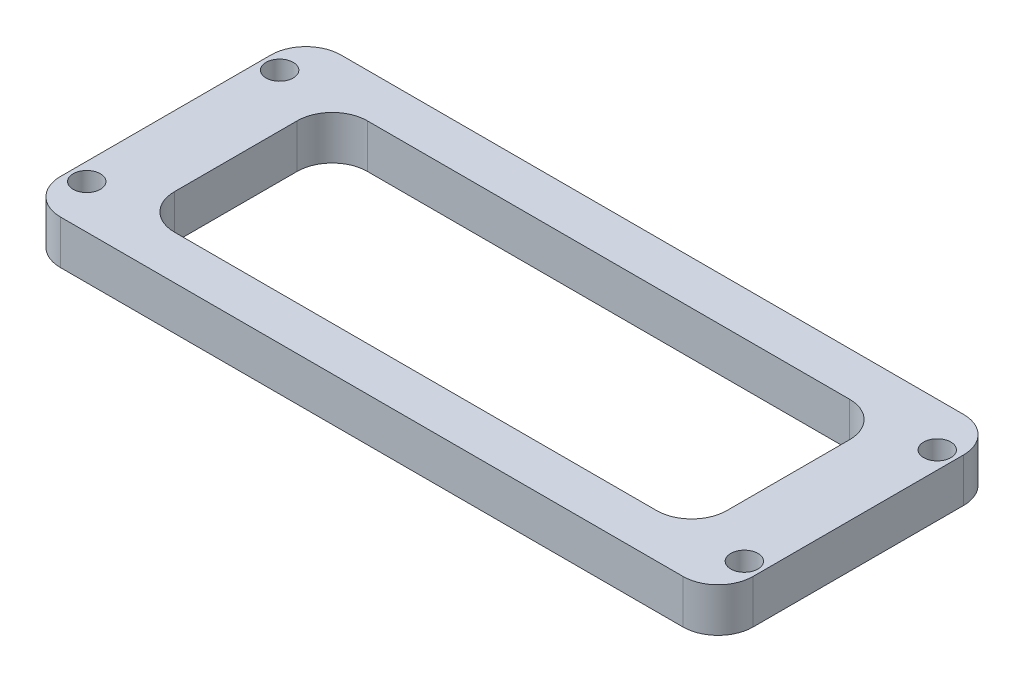
ISO-10303-21;
HEADER;
FILE_DESCRIPTION(('STEP AP214'),'2;1');
FILE_NAME('part.step','',(''),(''),'','','');
FILE_SCHEMA(('AUTOMOTIVE_DESIGN { 1 0 10303 214 1 1 1 1 }'));
ENDSEC;
DATA;
#1=APPLICATION_CONTEXT('core data for automotive mechanical design processes');
#2=APPLICATION_PROTOCOL_DEFINITION('international standard','automotive_design',2000,#1);
#3=PRODUCT_CONTEXT('',#1,'mechanical');
#4=PRODUCT('Part','Part','',(#3));
#5=PRODUCT_RELATED_PRODUCT_CATEGORY('part','',(#4));
#6=PRODUCT_DEFINITION_FORMATION('','',#4);
#7=PRODUCT_DEFINITION_CONTEXT('part definition',#1,'design');
#8=PRODUCT_DEFINITION('design','',#6,#7);
#9=PRODUCT_DEFINITION_SHAPE('','',#8);
#10=(LENGTH_UNIT() NAMED_UNIT(*) SI_UNIT(.MILLI.,.METRE.));
#11=(NAMED_UNIT(*) PLANE_ANGLE_UNIT() SI_UNIT($,.RADIAN.));
#12=(NAMED_UNIT(*) SI_UNIT($,.STERADIAN.) SOLID_ANGLE_UNIT());
#13=UNCERTAINTY_MEASURE_WITH_UNIT(LENGTH_MEASURE(1.E-05),#10,'distance_accuracy_value','');
#14=(GEOMETRIC_REPRESENTATION_CONTEXT(3) GLOBAL_UNCERTAINTY_ASSIGNED_CONTEXT((#13)) GLOBAL_UNIT_ASSIGNED_CONTEXT((#10,
#11,#12)) REPRESENTATION_CONTEXT('',''));
#15=CARTESIAN_POINT('',(0.,0.,0.));
#16=DIRECTION('',(0.,0.,1.));
#17=DIRECTION('',(1.,0.,0.));
#18=AXIS2_PLACEMENT_3D('',#15,#16,#17);
#19=CARTESIAN_POINT('',(0.,5.,0.));
#20=DIRECTION('',(0.,1.,0.));
#21=DIRECTION('',(0.,0.,1.));
#22=AXIS2_PLACEMENT_3D('',#19,#20,#21);
#23=PLANE('',#22);
#24=DIRECTION('',(0.,0.,-1.));
#25=VECTOR('',#24,1.);
#26=CARTESIAN_POINT('',(31.5,5.,-11.));
#27=LINE('',#26,#25);
#28=CARTESIAN_POINT('',(31.5,5.,7.));
#29=VERTEX_POINT('',#28);
#30=CARTESIAN_POINT('',(31.5,5.,-7.));
#31=VERTEX_POINT('',#30);
#32=EDGE_CURVE('E298',#29,#31,#27,.T.);
#33=ORIENTED_EDGE('',*,*,#32,.F.);
#34=CARTESIAN_POINT('',(27.5,5.,7.));
#35=DIRECTION('',(0.,1.,0.));
#36=DIRECTION('',(0.,0.,1.));
#37=AXIS2_PLACEMENT_3D('',#34,#35,#36);
#38=CIRCLE('',#37,4.);
#39=CARTESIAN_POINT('',(27.5,5.,11.));
#40=VERTEX_POINT('',#39);
#41=EDGE_CURVE('E275',#29,#40,#38,.F.);
#42=ORIENTED_EDGE('',*,*,#41,.T.);
#43=DIRECTION('',(1.,0.,0.));
#44=VECTOR('',#43,1.);
#45=CARTESIAN_POINT('',(-31.5,5.,11.));
#46=LINE('',#45,#44);
#47=CARTESIAN_POINT('',(-27.5,5.,11.));
#48=VERTEX_POINT('',#47);
#49=EDGE_CURVE('E324',#48,#40,#46,.T.);
#50=ORIENTED_EDGE('',*,*,#49,.F.);
#51=CARTESIAN_POINT('',(-27.5,5.,7.));
#52=DIRECTION('',(0.,1.,0.));
#53=DIRECTION('',(0.,0.,1.));
#54=AXIS2_PLACEMENT_3D('',#51,#52,#53);
#55=CIRCLE('',#54,4.);
#56=CARTESIAN_POINT('',(-31.5,5.,7.));
#57=VERTEX_POINT('',#56);
#58=EDGE_CURVE('E263',#48,#57,#55,.F.);
#59=ORIENTED_EDGE('',*,*,#58,.T.);
#60=DIRECTION('',(0.,0.,1.));
#61=VECTOR('',#60,1.);
#62=CARTESIAN_POINT('',(-31.5,5.,-11.));
#63=LINE('',#62,#61);
#64=CARTESIAN_POINT('',(-31.5,5.,-7.));
#65=VERTEX_POINT('',#64);
#66=EDGE_CURVE('E288',#65,#57,#63,.T.);
#67=ORIENTED_EDGE('',*,*,#66,.F.);
#68=CARTESIAN_POINT('',(-27.5,5.,-7.));
#69=DIRECTION('',(0.,1.,0.));
#70=DIRECTION('',(0.,0.,1.));
#71=AXIS2_PLACEMENT_3D('',#68,#69,#70);
#72=CIRCLE('',#71,4.);
#73=CARTESIAN_POINT('',(-27.5,5.,-11.));
#74=VERTEX_POINT('',#73);
#75=EDGE_CURVE('E48',#65,#74,#72,.F.);
#76=ORIENTED_EDGE('',*,*,#75,.T.);
#77=DIRECTION('',(-1.,0.,0.));
#78=VECTOR('',#77,1.);
#79=CARTESIAN_POINT('',(-31.5,5.,-11.));
#80=LINE('',#79,#78);
#81=CARTESIAN_POINT('',(27.5,5.,-11.));
#82=VERTEX_POINT('',#81);
#83=EDGE_CURVE('E286',#82,#74,#80,.T.);
#84=ORIENTED_EDGE('',*,*,#83,.F.);
#85=CARTESIAN_POINT('',(27.5,5.,-7.));
#86=DIRECTION('',(0.,1.,0.));
#87=DIRECTION('',(0.,0.,1.));
#88=AXIS2_PLACEMENT_3D('',#85,#86,#87);
#89=CIRCLE('',#88,4.);
#90=EDGE_CURVE('E269',#82,#31,#89,.F.);
#91=ORIENTED_EDGE('',*,*,#90,.T.);
#92=EDGE_LOOP('',(#33,#42,#50,#59,#67,#76,#84,#91));
#93=FACE_BOUND('',#92,.T.);
#94=CARTESIAN_POINT('',(37.5,5.,-11.));
#95=DIRECTION('',(0.,1.,0.));
#96=DIRECTION('',(0.,0.,1.));
#97=AXIS2_PLACEMENT_3D('',#94,#95,#96);
#98=CIRCLE('',#97,1.55);
#99=CARTESIAN_POINT('',(37.5,5.,-9.45));
#100=VERTEX_POINT('',#99);
#101=EDGE_CURVE('E336',#100,#100,#98,.T.);
#102=ORIENTED_EDGE('',*,*,#101,.F.);
#103=EDGE_LOOP('',(#102));
#104=FACE_BOUND('',#103,.T.);
#105=CARTESIAN_POINT('',(-37.5,5.,-11.));
#106=DIRECTION('',(0.,1.,0.));
#107=DIRECTION('',(0.,0.,1.));
#108=AXIS2_PLACEMENT_3D('',#105,#106,#107);
#109=CIRCLE('',#108,1.55);
#110=CARTESIAN_POINT('',(-37.5,5.,-9.45));
#111=VERTEX_POINT('',#110);
#112=EDGE_CURVE('E352',#111,#111,#109,.T.);
#113=ORIENTED_EDGE('',*,*,#112,.F.);
#114=EDGE_LOOP('',(#113));
#115=FACE_BOUND('',#114,.T.);
#116=DIRECTION('',(0.,0.,1.));
#117=VECTOR('',#116,1.);
#118=CARTESIAN_POINT('',(-39.5,5.,-16.));
#119=LINE('',#118,#117);
#120=CARTESIAN_POINT('',(-39.5,5.,-12.));
#121=VERTEX_POINT('',#120);
#122=CARTESIAN_POINT('',(-39.5,5.,12.));
#123=VERTEX_POINT('',#122);
#124=EDGE_CURVE('E363',#121,#123,#119,.T.);
#125=ORIENTED_EDGE('',*,*,#124,.T.);
#126=CARTESIAN_POINT('',(-35.5,5.,12.));
#127=DIRECTION('',(0.,1.,0.));
#128=DIRECTION('',(0.,0.,1.));
#129=AXIS2_PLACEMENT_3D('',#126,#127,#128);
#130=CIRCLE('',#129,4.);
#131=CARTESIAN_POINT('',(-35.5,5.,16.));
#132=VERTEX_POINT('',#131);
#133=EDGE_CURVE('E219',#123,#132,#130,.T.);
#134=ORIENTED_EDGE('',*,*,#133,.T.);
#135=DIRECTION('',(1.,0.,0.));
#136=VECTOR('',#135,1.);
#137=CARTESIAN_POINT('',(-39.5,5.,16.));
#138=LINE('',#137,#136);
#139=CARTESIAN_POINT('',(35.5,5.,16.));
#140=VERTEX_POINT('',#139);
#141=EDGE_CURVE('E175',#132,#140,#138,.T.);
#142=ORIENTED_EDGE('',*,*,#141,.T.);
#143=CARTESIAN_POINT('',(35.5,5.,12.));
#144=DIRECTION('',(0.,1.,0.));
#145=DIRECTION('',(0.,0.,1.));
#146=AXIS2_PLACEMENT_3D('',#143,#144,#145);
#147=CIRCLE('',#146,4.);
#148=CARTESIAN_POINT('',(39.5,5.,12.));
#149=VERTEX_POINT('',#148);
#150=EDGE_CURVE('E210',#140,#149,#147,.T.);
#151=ORIENTED_EDGE('',*,*,#150,.T.);
#152=DIRECTION('',(0.,0.,-1.));
#153=VECTOR('',#152,1.);
#154=CARTESIAN_POINT('',(39.5,5.,-16.));
#155=LINE('',#154,#153);
#156=CARTESIAN_POINT('',(39.5,5.,-12.));
#157=VERTEX_POINT('',#156);
#158=EDGE_CURVE('E184',#149,#157,#155,.T.);
#159=ORIENTED_EDGE('',*,*,#158,.T.);
#160=CARTESIAN_POINT('',(35.5,5.,-12.));
#161=DIRECTION('',(0.,1.,0.));
#162=DIRECTION('',(0.,0.,1.));
#163=AXIS2_PLACEMENT_3D('',#160,#161,#162);
#164=CIRCLE('',#163,4.);
#165=CARTESIAN_POINT('',(35.5,5.,-16.));
#166=VERTEX_POINT('',#165);
#167=EDGE_CURVE('E213',#157,#166,#164,.T.);
#168=ORIENTED_EDGE('',*,*,#167,.T.);
#169=DIRECTION('',(-1.,0.,0.));
#170=VECTOR('',#169,1.);
#171=CARTESIAN_POINT('',(-39.5,5.,-16.));
#172=LINE('',#171,#170);
#173=CARTESIAN_POINT('',(-35.5,5.,-16.));
#174=VERTEX_POINT('',#173);
#175=EDGE_CURVE('E190',#166,#174,#172,.T.);
#176=ORIENTED_EDGE('',*,*,#175,.T.);
#177=CARTESIAN_POINT('',(-35.5,5.,-12.));
#178=DIRECTION('',(0.,1.,0.));
#179=DIRECTION('',(0.,0.,1.));
#180=AXIS2_PLACEMENT_3D('',#177,#178,#179);
#181=CIRCLE('',#180,4.);
#182=EDGE_CURVE('E216',#174,#121,#181,.T.);
#183=ORIENTED_EDGE('',*,*,#182,.T.);
#184=EDGE_LOOP('',(#125,#134,#142,#151,#159,#168,#176,#183));
#185=FACE_BOUND('',#184,.T.);
#186=CARTESIAN_POINT('',(-37.5,5.,11.));
#187=DIRECTION('',(0.,1.,0.));
#188=DIRECTION('',(0.,0.,1.));
#189=AXIS2_PLACEMENT_3D('',#186,#187,#188);
#190=CIRCLE('',#189,1.54999999999999);
#191=CARTESIAN_POINT('',(-37.5,5.,12.55));
#192=VERTEX_POINT('',#191);
#193=EDGE_CURVE('E344',#192,#192,#190,.T.);
#194=ORIENTED_EDGE('',*,*,#193,.F.);
#195=EDGE_LOOP('',(#194));
#196=FACE_BOUND('',#195,.T.);
#197=CARTESIAN_POINT('',(37.5,5.,11.));
#198=DIRECTION('',(0.,1.,0.));
#199=DIRECTION('',(0.,0.,1.));
#200=AXIS2_PLACEMENT_3D('',#197,#198,#199);
#201=CIRCLE('',#200,1.55);
#202=CARTESIAN_POINT('',(37.5,5.,12.55));
#203=VERTEX_POINT('',#202);
#204=EDGE_CURVE('E328',#203,#203,#201,.T.);
#205=ORIENTED_EDGE('',*,*,#204,.F.);
#206=EDGE_LOOP('',(#205));
#207=FACE_BOUND('',#206,.T.);
#208=ADVANCED_FACE('F39',(#93,#104,#115,#185,#196,#207),#23,.T.);
#209=CARTESIAN_POINT('',(0.,0.,0.));
#210=DIRECTION('',(0.,1.,0.));
#211=DIRECTION('',(0.,0.,1.));
#212=AXIS2_PLACEMENT_3D('',#209,#210,#211);
#213=PLANE('',#212);
#214=DIRECTION('',(0.,0.,1.));
#215=VECTOR('',#214,1.);
#216=CARTESIAN_POINT('',(-31.5,0.,-11.));
#217=LINE('',#216,#215);
#218=CARTESIAN_POINT('',(-31.5,0.,-7.));
#219=VERTEX_POINT('',#218);
#220=CARTESIAN_POINT('',(-31.5,0.,7.));
#221=VERTEX_POINT('',#220);
#222=EDGE_CURVE('E303',#219,#221,#217,.T.);
#223=ORIENTED_EDGE('',*,*,#222,.T.);
#224=CARTESIAN_POINT('',(-27.5,0.,7.));
#225=DIRECTION('',(0.,1.,0.));
#226=DIRECTION('',(0.,0.,1.));
#227=AXIS2_PLACEMENT_3D('',#224,#225,#226);
#228=CIRCLE('',#227,4.);
#229=CARTESIAN_POINT('',(-27.5,0.,11.));
#230=VERTEX_POINT('',#229);
#231=EDGE_CURVE('E266',#221,#230,#228,.T.);
#232=ORIENTED_EDGE('',*,*,#231,.T.);
#233=DIRECTION('',(1.,0.,0.));
#234=VECTOR('',#233,1.);
#235=CARTESIAN_POINT('',(-31.5,0.,11.));
#236=LINE('',#235,#234);
#237=CARTESIAN_POINT('',(27.5,0.,11.));
#238=VERTEX_POINT('',#237);
#239=EDGE_CURVE('E310',#230,#238,#236,.T.);
#240=ORIENTED_EDGE('',*,*,#239,.T.);
#241=CARTESIAN_POINT('',(27.5,0.,7.));
#242=DIRECTION('',(0.,1.,0.));
#243=DIRECTION('',(0.,0.,1.));
#244=AXIS2_PLACEMENT_3D('',#241,#242,#243);
#245=CIRCLE('',#244,4.);
#246=CARTESIAN_POINT('',(31.5,0.,7.));
#247=VERTEX_POINT('',#246);
#248=EDGE_CURVE('E62',#238,#247,#245,.T.);
#249=ORIENTED_EDGE('',*,*,#248,.T.);
#250=DIRECTION('',(0.,0.,-1.));
#251=VECTOR('',#250,1.);
#252=CARTESIAN_POINT('',(31.5,0.,-11.));
#253=LINE('',#252,#251);
#254=CARTESIAN_POINT('',(31.5,0.,-7.));
#255=VERTEX_POINT('',#254);
#256=EDGE_CURVE('E316',#247,#255,#253,.T.);
#257=ORIENTED_EDGE('',*,*,#256,.T.);
#258=CARTESIAN_POINT('',(27.5,0.,-7.));
#259=DIRECTION('',(0.,1.,0.));
#260=DIRECTION('',(0.,0.,1.));
#261=AXIS2_PLACEMENT_3D('',#258,#259,#260);
#262=CIRCLE('',#261,4.);
#263=CARTESIAN_POINT('',(27.5,0.,-11.));
#264=VERTEX_POINT('',#263);
#265=EDGE_CURVE('E272',#255,#264,#262,.T.);
#266=ORIENTED_EDGE('',*,*,#265,.T.);
#267=DIRECTION('',(-1.,0.,0.));
#268=VECTOR('',#267,1.);
#269=CARTESIAN_POINT('',(-31.5,0.,-11.));
#270=LINE('',#269,#268);
#271=CARTESIAN_POINT('',(-27.5,0.,-11.));
#272=VERTEX_POINT('',#271);
#273=EDGE_CURVE('E305',#264,#272,#270,.T.);
#274=ORIENTED_EDGE('',*,*,#273,.T.);
#275=CARTESIAN_POINT('',(-27.5,0.,-7.));
#276=DIRECTION('',(0.,1.,0.));
#277=DIRECTION('',(0.,0.,1.));
#278=AXIS2_PLACEMENT_3D('',#275,#276,#277);
#279=CIRCLE('',#278,4.);
#280=EDGE_CURVE('E11',#272,#219,#279,.T.);
#281=ORIENTED_EDGE('',*,*,#280,.T.);
#282=EDGE_LOOP('',(#223,#232,#240,#249,#257,#266,#274,#281));
#283=FACE_BOUND('',#282,.T.);
#284=DIRECTION('',(1.,0.,0.));
#285=VECTOR('',#284,1.);
#286=CARTESIAN_POINT('',(-39.5,0.,16.));
#287=LINE('',#286,#285);
#288=CARTESIAN_POINT('',(-35.5,0.,16.));
#289=VERTEX_POINT('',#288);
#290=CARTESIAN_POINT('',(35.5,0.,16.));
#291=VERTEX_POINT('',#290);
#292=EDGE_CURVE('E172',#289,#291,#287,.T.);
#293=ORIENTED_EDGE('',*,*,#292,.F.);
#294=CARTESIAN_POINT('',(-35.5,0.,12.));
#295=DIRECTION('',(0.,1.,0.));
#296=DIRECTION('',(0.,0.,1.));
#297=AXIS2_PLACEMENT_3D('',#294,#295,#296);
#298=CIRCLE('',#297,4.);
#299=CARTESIAN_POINT('',(-39.5,0.,12.));
#300=VERTEX_POINT('',#299);
#301=EDGE_CURVE('E154',#289,#300,#298,.F.);
#302=ORIENTED_EDGE('',*,*,#301,.T.);
#303=DIRECTION('',(0.,0.,1.));
#304=VECTOR('',#303,1.);
#305=CARTESIAN_POINT('',(-39.5,0.,-16.));
#306=LINE('',#305,#304);
#307=CARTESIAN_POINT('',(-39.5,0.,-12.));
#308=VERTEX_POINT('',#307);
#309=EDGE_CURVE('E185',#308,#300,#306,.T.);
#310=ORIENTED_EDGE('',*,*,#309,.F.);
#311=CARTESIAN_POINT('',(-35.5,0.,-12.));
#312=DIRECTION('',(0.,1.,0.));
#313=DIRECTION('',(0.,0.,1.));
#314=AXIS2_PLACEMENT_3D('',#311,#312,#313);
#315=CIRCLE('',#314,4.);
#316=CARTESIAN_POINT('',(-35.5,0.,-16.));
#317=VERTEX_POINT('',#316);
#318=EDGE_CURVE('E166',#308,#317,#315,.F.);
#319=ORIENTED_EDGE('',*,*,#318,.T.);
#320=DIRECTION('',(-1.,0.,0.));
#321=VECTOR('',#320,1.);
#322=CARTESIAN_POINT('',(-39.5,0.,-16.));
#323=LINE('',#322,#321);
#324=CARTESIAN_POINT('',(35.5,0.,-16.));
#325=VERTEX_POINT('',#324);
#326=EDGE_CURVE('E192',#325,#317,#323,.T.);
#327=ORIENTED_EDGE('',*,*,#326,.F.);
#328=CARTESIAN_POINT('',(35.5,0.,-12.));
#329=DIRECTION('',(0.,1.,0.));
#330=DIRECTION('',(0.,0.,1.));
#331=AXIS2_PLACEMENT_3D('',#328,#329,#330);
#332=CIRCLE('',#331,4.);
#333=CARTESIAN_POINT('',(39.5,0.,-12.));
#334=VERTEX_POINT('',#333);
#335=EDGE_CURVE('E200',#325,#334,#332,.F.);
#336=ORIENTED_EDGE('',*,*,#335,.T.);
#337=DIRECTION('',(0.,0.,-1.));
#338=VECTOR('',#337,1.);
#339=CARTESIAN_POINT('',(39.5,0.,-16.));
#340=LINE('',#339,#338);
#341=CARTESIAN_POINT('',(39.5,0.,12.));
#342=VERTEX_POINT('',#341);
#343=EDGE_CURVE('E356',#342,#334,#340,.T.);
#344=ORIENTED_EDGE('',*,*,#343,.F.);
#345=CARTESIAN_POINT('',(35.5,0.,12.));
#346=DIRECTION('',(0.,1.,0.));
#347=DIRECTION('',(0.,0.,1.));
#348=AXIS2_PLACEMENT_3D('',#345,#346,#347);
#349=CIRCLE('',#348,4.);
#350=EDGE_CURVE('E177',#342,#291,#349,.F.);
#351=ORIENTED_EDGE('',*,*,#350,.T.);
#352=EDGE_LOOP('',(#293,#302,#310,#319,#327,#336,#344,#351));
#353=FACE_BOUND('',#352,.T.);
#354=CARTESIAN_POINT('',(-37.5,0.,-11.));
#355=DIRECTION('',(0.,1.,0.));
#356=DIRECTION('',(0.,0.,1.));
#357=AXIS2_PLACEMENT_3D('',#354,#355,#356);
#358=CIRCLE('',#357,1.55);
#359=CARTESIAN_POINT('',(-37.5,0.,-9.45));
#360=VERTEX_POINT('',#359);
#361=EDGE_CURVE('E348',#360,#360,#358,.T.);
#362=ORIENTED_EDGE('',*,*,#361,.T.);
#363=EDGE_LOOP('',(#362));
#364=FACE_BOUND('',#363,.T.);
#365=CARTESIAN_POINT('',(-37.5,0.,11.));
#366=DIRECTION('',(0.,1.,0.));
#367=DIRECTION('',(0.,0.,1.));
#368=AXIS2_PLACEMENT_3D('',#365,#366,#367);
#369=CIRCLE('',#368,1.54999999999999);
#370=CARTESIAN_POINT('',(-37.5,0.,12.55));
#371=VERTEX_POINT('',#370);
#372=EDGE_CURVE('E340',#371,#371,#369,.T.);
#373=ORIENTED_EDGE('',*,*,#372,.T.);
#374=EDGE_LOOP('',(#373));
#375=FACE_BOUND('',#374,.T.);
#376=CARTESIAN_POINT('',(37.5,0.,-11.));
#377=DIRECTION('',(0.,1.,0.));
#378=DIRECTION('',(0.,0.,1.));
#379=AXIS2_PLACEMENT_3D('',#376,#377,#378);
#380=CIRCLE('',#379,1.55);
#381=CARTESIAN_POINT('',(37.5,0.,-9.45));
#382=VERTEX_POINT('',#381);
#383=EDGE_CURVE('E332',#382,#382,#380,.T.);
#384=ORIENTED_EDGE('',*,*,#383,.T.);
#385=EDGE_LOOP('',(#384));
#386=FACE_BOUND('',#385,.T.);
#387=CARTESIAN_POINT('',(37.5,0.,11.));
#388=DIRECTION('',(0.,1.,0.));
#389=DIRECTION('',(0.,0.,1.));
#390=AXIS2_PLACEMENT_3D('',#387,#388,#389);
#391=CIRCLE('',#390,1.55);
#392=CARTESIAN_POINT('',(37.5,0.,12.55));
#393=VERTEX_POINT('',#392);
#394=EDGE_CURVE('E314',#393,#393,#391,.T.);
#395=ORIENTED_EDGE('',*,*,#394,.T.);
#396=EDGE_LOOP('',(#395));
#397=FACE_BOUND('',#396,.T.);
#398=ADVANCED_FACE('F180',(#283,#353,#364,#375,#386,#397),#213,.F.);
#399=CARTESIAN_POINT('',(39.5,5.,-16.));
#400=DIRECTION('',(-1.,0.,0.));
#401=DIRECTION('',(0.,0.,1.));
#402=AXIS2_PLACEMENT_3D('',#399,#400,#401);
#403=PLANE('',#402);
#404=ORIENTED_EDGE('',*,*,#343,.T.);
#405=DIRECTION('',(0.,-1.,0.));
#406=VECTOR('',#405,1.);
#407=CARTESIAN_POINT('',(39.5,5.,-12.));
#408=LINE('',#407,#406);
#409=EDGE_CURVE('E233',#334,#157,#408,.F.);
#410=ORIENTED_EDGE('',*,*,#409,.T.);
#411=ORIENTED_EDGE('',*,*,#158,.F.);
#412=DIRECTION('',(0.,-1.,0.));
#413=VECTOR('',#412,1.);
#414=CARTESIAN_POINT('',(39.5,5.,12.));
#415=LINE('',#414,#413);
#416=EDGE_CURVE('E229',#149,#342,#415,.T.);
#417=ORIENTED_EDGE('',*,*,#416,.T.);
#418=EDGE_LOOP('',(#404,#410,#411,#417));
#419=FACE_BOUND('',#418,.T.);
#420=ADVANCED_FACE('F396',(#419),#403,.F.);
#421=CARTESIAN_POINT('',(-39.5,5.,-16.));
#422=DIRECTION('',(0.,0.,1.));
#423=DIRECTION('',(1.,0.,0.));
#424=AXIS2_PLACEMENT_3D('',#421,#422,#423);
#425=PLANE('',#424);
#426=ORIENTED_EDGE('',*,*,#326,.T.);
#427=DIRECTION('',(0.,-1.,0.));
#428=VECTOR('',#427,1.);
#429=CARTESIAN_POINT('',(-35.5,5.,-16.));
#430=LINE('',#429,#428);
#431=EDGE_CURVE('E226',#317,#174,#430,.F.);
#432=ORIENTED_EDGE('',*,*,#431,.T.);
#433=ORIENTED_EDGE('',*,*,#175,.F.);
#434=DIRECTION('',(0.,-1.,0.));
#435=VECTOR('',#434,1.);
#436=CARTESIAN_POINT('',(35.5,5.,-16.));
#437=LINE('',#436,#435);
#438=EDGE_CURVE('E222',#166,#325,#437,.T.);
#439=ORIENTED_EDGE('',*,*,#438,.T.);
#440=EDGE_LOOP('',(#426,#432,#433,#439));
#441=FACE_BOUND('',#440,.T.);
#442=ADVANCED_FACE('F376',(#441),#425,.F.);
#443=CARTESIAN_POINT('',(-39.5,5.,-16.));
#444=DIRECTION('',(1.,0.,0.));
#445=DIRECTION('',(0.,0.,-1.));
#446=AXIS2_PLACEMENT_3D('',#443,#444,#445);
#447=PLANE('',#446);
#448=ORIENTED_EDGE('',*,*,#309,.T.);
#449=DIRECTION('',(0.,-1.,0.));
#450=VECTOR('',#449,1.);
#451=CARTESIAN_POINT('',(-39.5,5.,12.));
#452=LINE('',#451,#450);
#453=EDGE_CURVE('E159',#300,#123,#452,.F.);
#454=ORIENTED_EDGE('',*,*,#453,.T.);
#455=ORIENTED_EDGE('',*,*,#124,.F.);
#456=DIRECTION('',(0.,-1.,0.));
#457=VECTOR('',#456,1.);
#458=CARTESIAN_POINT('',(-39.5,5.,-12.));
#459=LINE('',#458,#457);
#460=EDGE_CURVE('E165',#121,#308,#459,.T.);
#461=ORIENTED_EDGE('',*,*,#460,.T.);
#462=EDGE_LOOP('',(#448,#454,#455,#461));
#463=FACE_BOUND('',#462,.T.);
#464=ADVANCED_FACE('F387',(#463),#447,.F.);
#465=CARTESIAN_POINT('',(-39.5,5.,16.));
#466=DIRECTION('',(0.,0.,-1.));
#467=DIRECTION('',(-1.,0.,0.));
#468=AXIS2_PLACEMENT_3D('',#465,#466,#467);
#469=PLANE('',#468);
#470=ORIENTED_EDGE('',*,*,#141,.F.);
#471=DIRECTION('',(0.,-1.,0.));
#472=VECTOR('',#471,1.);
#473=CARTESIAN_POINT('',(-35.5,5.,16.));
#474=LINE('',#473,#472);
#475=EDGE_CURVE('E158',#132,#289,#474,.T.);
#476=ORIENTED_EDGE('',*,*,#475,.T.);
#477=ORIENTED_EDGE('',*,*,#292,.T.);
#478=DIRECTION('',(0.,-1.,0.));
#479=VECTOR('',#478,1.);
#480=CARTESIAN_POINT('',(35.5,5.,16.));
#481=LINE('',#480,#479);
#482=EDGE_CURVE('E178',#291,#140,#481,.F.);
#483=ORIENTED_EDGE('',*,*,#482,.T.);
#484=EDGE_LOOP('',(#470,#476,#477,#483));
#485=FACE_BOUND('',#484,.T.);
#486=ADVANCED_FACE('F171',(#485),#469,.F.);
#487=CARTESIAN_POINT('',(-37.5,5.,-11.));
#488=DIRECTION('',(0.,-1.,0.));
#489=DIRECTION('',(0.,0.,-1.));
#490=AXIS2_PLACEMENT_3D('',#487,#488,#489);
#491=CYLINDRICAL_SURFACE('',#490,1.55);
#492=ORIENTED_EDGE('',*,*,#112,.T.);
#493=EDGE_LOOP('',(#492));
#494=FACE_BOUND('',#493,.T.);
#495=ORIENTED_EDGE('',*,*,#361,.F.);
#496=EDGE_LOOP('',(#495));
#497=FACE_BOUND('',#496,.T.);
#498=ADVANCED_FACE('F394',(#494,#497),#491,.F.);
#499=CARTESIAN_POINT('',(-37.5,5.,11.));
#500=DIRECTION('',(0.,-1.,0.));
#501=DIRECTION('',(0.,0.,-1.));
#502=AXIS2_PLACEMENT_3D('',#499,#500,#501);
#503=CYLINDRICAL_SURFACE('',#502,1.54999999999999);
#504=ORIENTED_EDGE('',*,*,#193,.T.);
#505=EDGE_LOOP('',(#504));
#506=FACE_BOUND('',#505,.T.);
#507=ORIENTED_EDGE('',*,*,#372,.F.);
#508=EDGE_LOOP('',(#507));
#509=FACE_BOUND('',#508,.T.);
#510=ADVANCED_FACE('F407',(#506,#509),#503,.F.);
#511=CARTESIAN_POINT('',(37.5,5.,-11.));
#512=DIRECTION('',(0.,-1.,0.));
#513=DIRECTION('',(0.,0.,-1.));
#514=AXIS2_PLACEMENT_3D('',#511,#512,#513);
#515=CYLINDRICAL_SURFACE('',#514,1.55);
#516=ORIENTED_EDGE('',*,*,#101,.T.);
#517=EDGE_LOOP('',(#516));
#518=FACE_BOUND('',#517,.T.);
#519=ORIENTED_EDGE('',*,*,#383,.F.);
#520=EDGE_LOOP('',(#519));
#521=FACE_BOUND('',#520,.T.);
#522=ADVANCED_FACE('F411',(#518,#521),#515,.F.);
#523=CARTESIAN_POINT('',(37.5,5.,11.));
#524=DIRECTION('',(0.,-1.,0.));
#525=DIRECTION('',(0.,0.,-1.));
#526=AXIS2_PLACEMENT_3D('',#523,#524,#525);
#527=CYLINDRICAL_SURFACE('',#526,1.55);
#528=ORIENTED_EDGE('',*,*,#204,.T.);
#529=EDGE_LOOP('',(#528));
#530=FACE_BOUND('',#529,.T.);
#531=ORIENTED_EDGE('',*,*,#394,.F.);
#532=EDGE_LOOP('',(#531));
#533=FACE_BOUND('',#532,.T.);
#534=ADVANCED_FACE('F415',(#530,#533),#527,.F.);
#535=CARTESIAN_POINT('',(-35.5,5.,12.));
#536=DIRECTION('',(0.,-1.,0.));
#537=DIRECTION('',(0.,0.,-1.));
#538=AXIS2_PLACEMENT_3D('',#535,#536,#537);
#539=CYLINDRICAL_SURFACE('',#538,4.);
#540=ORIENTED_EDGE('',*,*,#133,.F.);
#541=ORIENTED_EDGE('',*,*,#453,.F.);
#542=ORIENTED_EDGE('',*,*,#301,.F.);
#543=ORIENTED_EDGE('',*,*,#475,.F.);
#544=EDGE_LOOP('',(#540,#541,#542,#543));
#545=FACE_BOUND('',#544,.T.);
#546=ADVANCED_FACE('F157',(#545),#539,.T.);
#547=CARTESIAN_POINT('',(-35.5,5.,-12.));
#548=DIRECTION('',(0.,-1.,0.));
#549=DIRECTION('',(0.,0.,-1.));
#550=AXIS2_PLACEMENT_3D('',#547,#548,#549);
#551=CYLINDRICAL_SURFACE('',#550,4.);
#552=ORIENTED_EDGE('',*,*,#182,.F.);
#553=ORIENTED_EDGE('',*,*,#431,.F.);
#554=ORIENTED_EDGE('',*,*,#318,.F.);
#555=ORIENTED_EDGE('',*,*,#460,.F.);
#556=EDGE_LOOP('',(#552,#553,#554,#555));
#557=FACE_BOUND('',#556,.T.);
#558=ADVANCED_FACE('F381',(#557),#551,.T.);
#559=CARTESIAN_POINT('',(35.5,5.,-12.));
#560=DIRECTION('',(0.,-1.,0.));
#561=DIRECTION('',(0.,0.,-1.));
#562=AXIS2_PLACEMENT_3D('',#559,#560,#561);
#563=CYLINDRICAL_SURFACE('',#562,4.);
#564=ORIENTED_EDGE('',*,*,#167,.F.);
#565=ORIENTED_EDGE('',*,*,#409,.F.);
#566=ORIENTED_EDGE('',*,*,#335,.F.);
#567=ORIENTED_EDGE('',*,*,#438,.F.);
#568=EDGE_LOOP('',(#564,#565,#566,#567));
#569=FACE_BOUND('',#568,.T.);
#570=ADVANCED_FACE('F456',(#569),#563,.T.);
#571=CARTESIAN_POINT('',(35.5,5.,12.));
#572=DIRECTION('',(0.,-1.,0.));
#573=DIRECTION('',(0.,0.,-1.));
#574=AXIS2_PLACEMENT_3D('',#571,#572,#573);
#575=CYLINDRICAL_SURFACE('',#574,4.);
#576=ORIENTED_EDGE('',*,*,#150,.F.);
#577=ORIENTED_EDGE('',*,*,#482,.F.);
#578=ORIENTED_EDGE('',*,*,#350,.F.);
#579=ORIENTED_EDGE('',*,*,#416,.F.);
#580=EDGE_LOOP('',(#576,#577,#578,#579));
#581=FACE_BOUND('',#580,.T.);
#582=ADVANCED_FACE('F424',(#581),#575,.T.);
#583=CARTESIAN_POINT('',(31.5,0.,-11.));
#584=DIRECTION('',(1.,0.,0.));
#585=DIRECTION('',(0.,0.,-1.));
#586=AXIS2_PLACEMENT_3D('',#583,#584,#585);
#587=PLANE('',#586);
#588=ORIENTED_EDGE('',*,*,#32,.T.);
#589=DIRECTION('',(0.,1.,0.));
#590=VECTOR('',#589,1.);
#591=CARTESIAN_POINT('',(31.5,0.,-7.));
#592=LINE('',#591,#590);
#593=EDGE_CURVE('E55',#31,#255,#592,.F.);
#594=ORIENTED_EDGE('',*,*,#593,.T.);
#595=ORIENTED_EDGE('',*,*,#256,.F.);
#596=DIRECTION('',(0.,1.,0.));
#597=VECTOR('',#596,1.);
#598=CARTESIAN_POINT('',(31.5,5.,7.));
#599=LINE('',#598,#597);
#600=EDGE_CURVE('E257',#247,#29,#599,.T.);
#601=ORIENTED_EDGE('',*,*,#600,.T.);
#602=EDGE_LOOP('',(#588,#594,#595,#601));
#603=FACE_BOUND('',#602,.T.);
#604=ADVANCED_FACE('F420',(#603),#587,.F.);
#605=CARTESIAN_POINT('',(-31.5,0.,11.));
#606=DIRECTION('',(0.,0.,1.));
#607=DIRECTION('',(1.,0.,0.));
#608=AXIS2_PLACEMENT_3D('',#605,#606,#607);
#609=PLANE('',#608);
#610=ORIENTED_EDGE('',*,*,#239,.F.);
#611=DIRECTION('',(0.,1.,0.));
#612=VECTOR('',#611,1.);
#613=CARTESIAN_POINT('',(-27.5,5.,11.));
#614=LINE('',#613,#612);
#615=EDGE_CURVE('E239',#230,#48,#614,.T.);
#616=ORIENTED_EDGE('',*,*,#615,.T.);
#617=ORIENTED_EDGE('',*,*,#49,.T.);
#618=DIRECTION('',(0.,1.,0.));
#619=VECTOR('',#618,1.);
#620=CARTESIAN_POINT('',(27.5,0.,11.));
#621=LINE('',#620,#619);
#622=EDGE_CURVE('E236',#40,#238,#621,.F.);
#623=ORIENTED_EDGE('',*,*,#622,.T.);
#624=EDGE_LOOP('',(#610,#616,#617,#623));
#625=FACE_BOUND('',#624,.T.);
#626=ADVANCED_FACE('F423',(#625),#609,.F.);
#627=CARTESIAN_POINT('',(-31.5,0.,-11.));
#628=DIRECTION('',(-1.,0.,0.));
#629=DIRECTION('',(0.,0.,1.));
#630=AXIS2_PLACEMENT_3D('',#627,#628,#629);
#631=PLANE('',#630);
#632=ORIENTED_EDGE('',*,*,#66,.T.);
#633=DIRECTION('',(0.,1.,0.));
#634=VECTOR('',#633,1.);
#635=CARTESIAN_POINT('',(-31.5,0.,7.));
#636=LINE('',#635,#634);
#637=EDGE_CURVE('E247',#57,#221,#636,.F.);
#638=ORIENTED_EDGE('',*,*,#637,.T.);
#639=ORIENTED_EDGE('',*,*,#222,.F.);
#640=DIRECTION('',(0.,1.,0.));
#641=VECTOR('',#640,1.);
#642=CARTESIAN_POINT('',(-31.5,5.,-7.));
#643=LINE('',#642,#641);
#644=EDGE_CURVE('E243',#219,#65,#643,.T.);
#645=ORIENTED_EDGE('',*,*,#644,.T.);
#646=EDGE_LOOP('',(#632,#638,#639,#645));
#647=FACE_BOUND('',#646,.T.);
#648=ADVANCED_FACE('F307',(#647),#631,.F.);
#649=CARTESIAN_POINT('',(-31.5,0.,-11.));
#650=DIRECTION('',(0.,0.,-1.));
#651=DIRECTION('',(-1.,0.,0.));
#652=AXIS2_PLACEMENT_3D('',#649,#650,#651);
#653=PLANE('',#652);
#654=ORIENTED_EDGE('',*,*,#273,.F.);
#655=DIRECTION('',(0.,1.,0.));
#656=VECTOR('',#655,1.);
#657=CARTESIAN_POINT('',(27.5,5.,-11.));
#658=LINE('',#657,#656);
#659=EDGE_CURVE('E253',#264,#82,#658,.T.);
#660=ORIENTED_EDGE('',*,*,#659,.T.);
#661=ORIENTED_EDGE('',*,*,#83,.T.);
#662=DIRECTION('',(0.,1.,0.));
#663=VECTOR('',#662,1.);
#664=CARTESIAN_POINT('',(-27.5,0.,-11.));
#665=LINE('',#664,#663);
#666=EDGE_CURVE('E250',#74,#272,#665,.F.);
#667=ORIENTED_EDGE('',*,*,#666,.T.);
#668=EDGE_LOOP('',(#654,#660,#661,#667));
#669=FACE_BOUND('',#668,.T.);
#670=ADVANCED_FACE('F294',(#669),#653,.F.);
#671=CARTESIAN_POINT('',(-27.5,0.,7.));
#672=DIRECTION('',(0.,-1.,0.));
#673=DIRECTION('',(0.,0.,-1.));
#674=AXIS2_PLACEMENT_3D('',#671,#672,#673);
#675=CYLINDRICAL_SURFACE('',#674,4.);
#676=ORIENTED_EDGE('',*,*,#231,.F.);
#677=ORIENTED_EDGE('',*,*,#637,.F.);
#678=ORIENTED_EDGE('',*,*,#58,.F.);
#679=ORIENTED_EDGE('',*,*,#615,.F.);
#680=EDGE_LOOP('',(#676,#677,#678,#679));
#681=FACE_BOUND('',#680,.T.);
#682=ADVANCED_FACE('F427',(#681),#675,.F.);
#683=CARTESIAN_POINT('',(27.5,0.,-7.));
#684=DIRECTION('',(0.,-1.,0.));
#685=DIRECTION('',(0.,0.,-1.));
#686=AXIS2_PLACEMENT_3D('',#683,#684,#685);
#687=CYLINDRICAL_SURFACE('',#686,4.);
#688=ORIENTED_EDGE('',*,*,#265,.F.);
#689=ORIENTED_EDGE('',*,*,#593,.F.);
#690=ORIENTED_EDGE('',*,*,#90,.F.);
#691=ORIENTED_EDGE('',*,*,#659,.F.);
#692=EDGE_LOOP('',(#688,#689,#690,#691));
#693=FACE_BOUND('',#692,.T.);
#694=ADVANCED_FACE('F444',(#693),#687,.F.);
#695=CARTESIAN_POINT('',(27.5,0.,7.));
#696=DIRECTION('',(0.,-1.,0.));
#697=DIRECTION('',(0.,0.,-1.));
#698=AXIS2_PLACEMENT_3D('',#695,#696,#697);
#699=CYLINDRICAL_SURFACE('',#698,4.);
#700=ORIENTED_EDGE('',*,*,#248,.F.);
#701=ORIENTED_EDGE('',*,*,#622,.F.);
#702=ORIENTED_EDGE('',*,*,#41,.F.);
#703=ORIENTED_EDGE('',*,*,#600,.F.);
#704=EDGE_LOOP('',(#700,#701,#702,#703));
#705=FACE_BOUND('',#704,.T.);
#706=ADVANCED_FACE('F440',(#705),#699,.F.);
#707=CARTESIAN_POINT('',(-27.5,0.,-7.));
#708=DIRECTION('',(0.,-1.,0.));
#709=DIRECTION('',(0.,0.,-1.));
#710=AXIS2_PLACEMENT_3D('',#707,#708,#709);
#711=CYLINDRICAL_SURFACE('',#710,4.);
#712=ORIENTED_EDGE('',*,*,#280,.F.);
#713=ORIENTED_EDGE('',*,*,#666,.F.);
#714=ORIENTED_EDGE('',*,*,#75,.F.);
#715=ORIENTED_EDGE('',*,*,#644,.F.);
#716=EDGE_LOOP('',(#712,#713,#714,#715));
#717=FACE_BOUND('',#716,.T.);
#718=ADVANCED_FACE('F41',(#717),#711,.F.);
#719=CLOSED_SHELL('',(#208,#398,#420,#442,#464,#486,#498,#510,#522,#534,#546,#558,#570,#582,
#604,#626,#648,#670,#682,#694,#706,#718));
#720=MANIFOLD_SOLID_BREP('B2',#719);
#721=ADVANCED_BREP_SHAPE_REPRESENTATION('',(#18,#720),#14);
#722=SHAPE_DEFINITION_REPRESENTATION(#9,#721);
ENDSEC;
END-ISO-10303-21;
